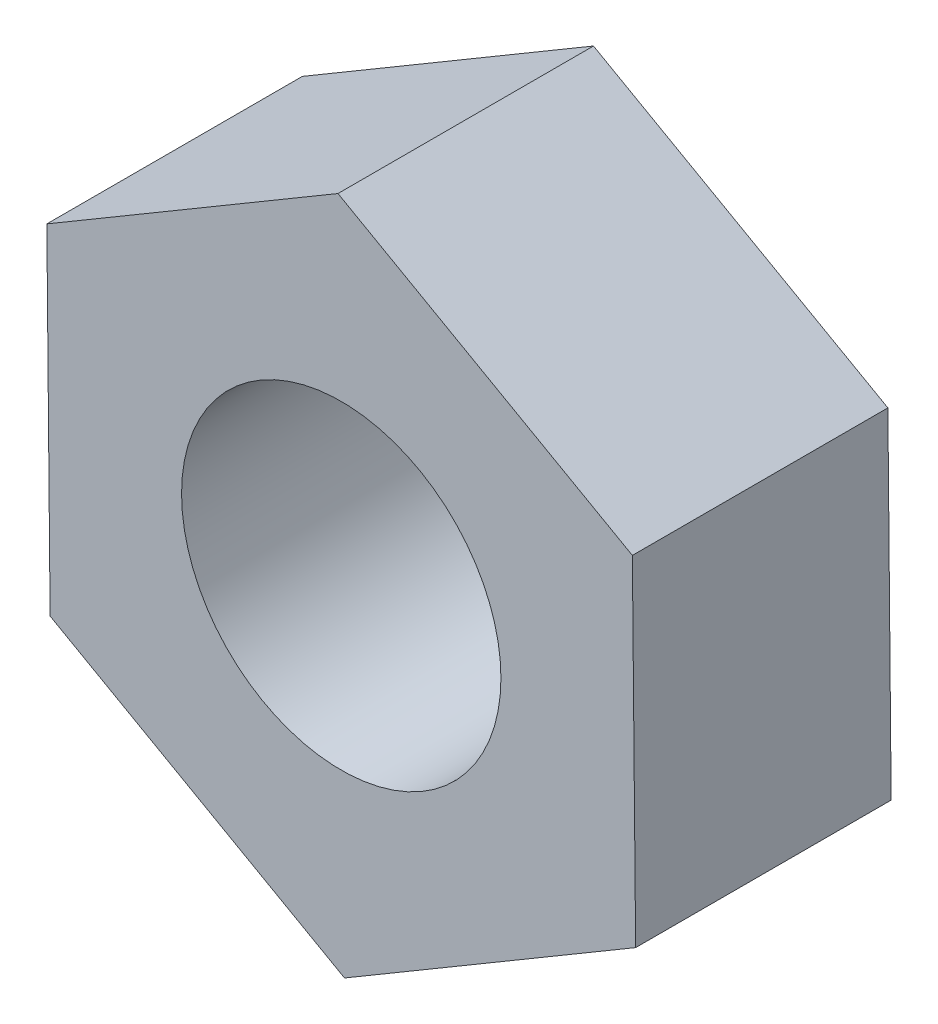
ISO-10303-21;
HEADER;
FILE_DESCRIPTION(('STEP AP214'),'2;1');
FILE_NAME('part.step','',(''),(''),'','','');
FILE_SCHEMA(('AUTOMOTIVE_DESIGN { 1 0 10303 214 1 1 1 1 }'));
ENDSEC;
DATA;
#1=APPLICATION_CONTEXT('core data for automotive mechanical design processes');
#2=APPLICATION_PROTOCOL_DEFINITION('international standard','automotive_design',2000,#1);
#3=PRODUCT_CONTEXT('',#1,'mechanical');
#4=PRODUCT('Part','Part','',(#3));
#5=PRODUCT_RELATED_PRODUCT_CATEGORY('part','',(#4));
#6=PRODUCT_DEFINITION_FORMATION('','',#4);
#7=PRODUCT_DEFINITION_CONTEXT('part definition',#1,'design');
#8=PRODUCT_DEFINITION('design','',#6,#7);
#9=PRODUCT_DEFINITION_SHAPE('','',#8);
#10=(LENGTH_UNIT() NAMED_UNIT(*) SI_UNIT(.MILLI.,.METRE.));
#11=(NAMED_UNIT(*) PLANE_ANGLE_UNIT() SI_UNIT($,.RADIAN.));
#12=(NAMED_UNIT(*) SI_UNIT($,.STERADIAN.) SOLID_ANGLE_UNIT());
#13=UNCERTAINTY_MEASURE_WITH_UNIT(LENGTH_MEASURE(1.E-05),#10,'distance_accuracy_value','');
#14=(GEOMETRIC_REPRESENTATION_CONTEXT(3) GLOBAL_UNCERTAINTY_ASSIGNED_CONTEXT((#13)) GLOBAL_UNIT_ASSIGNED_CONTEXT((#10,
#11,#12)) REPRESENTATION_CONTEXT('',''));
#15=CARTESIAN_POINT('',(0.,0.,0.));
#16=DIRECTION('',(0.,0.,1.));
#17=DIRECTION('',(1.,0.,0.));
#18=AXIS2_PLACEMENT_3D('',#15,#16,#17);
#19=CARTESIAN_POINT('',(0.,0.,2.4));
#20=DIRECTION('',(0.,0.,1.));
#21=DIRECTION('',(1.,0.,0.));
#22=AXIS2_PLACEMENT_3D('',#19,#20,#21);
#23=PLANE('',#22);
#24=DIRECTION('',(0.86114536562663,0.50835878989133,0.));
#25=VECTOR('',#24,1.);
#26=CARTESIAN_POINT('',(-6.3550111655688,20.9290963658217,2.4));
#27=LINE('',#26,#25);
#28=CARTESIAN_POINT('',(-6.3550111655688,20.9290963658217,2.4));
#29=VERTEX_POINT('',#28);
#30=CARTESIAN_POINT('',(-3.62050736796117,22.5433523288594,2.4));
#31=VERTEX_POINT('',#30);
#32=EDGE_CURVE('E133',#29,#31,#27,.T.);
#33=ORIENTED_EDGE('',*,*,#32,.T.);
#34=DIRECTION('',(-0.0096789434696921,0.999953157929566,0.));
#35=VECTOR('',#34,1.);
#36=CARTESIAN_POINT('',(-3.62050736796117,22.5433523288594,2.4));
#37=LINE('',#36,#35);
#38=CARTESIAN_POINT('',(-3.6512421413585,25.7186300658515,2.4));
#39=VERTEX_POINT('',#38);
#40=EDGE_CURVE('E91',#31,#39,#37,.T.);
#41=ORIENTED_EDGE('',*,*,#40,.T.);
#42=DIRECTION('',(-0.870824309096322,0.491594368038237,0.));
#43=VECTOR('',#42,1.);
#44=CARTESIAN_POINT('',(-3.6512421413585,25.7186300658515,2.4));
#45=LINE('',#44,#43);
#46=CARTESIAN_POINT('',(-6.41648071236348,27.2796518398058,2.4));
#47=VERTEX_POINT('',#46);
#48=EDGE_CURVE('E104',#39,#47,#45,.T.);
#49=ORIENTED_EDGE('',*,*,#48,.T.);
#50=DIRECTION('',(-0.86114536562663,-0.50835878989133,0.));
#51=VECTOR('',#50,1.);
#52=CARTESIAN_POINT('',(-6.41648071236348,27.2796518398058,2.4));
#53=LINE('',#52,#51);
#54=CARTESIAN_POINT('',(-9.15098450997112,25.6653958767681,2.4));
#55=VERTEX_POINT('',#54);
#56=EDGE_CURVE('E98',#47,#55,#53,.T.);
#57=ORIENTED_EDGE('',*,*,#56,.T.);
#58=DIRECTION('',(0.00967894346969265,-0.999953157929566,0.));
#59=VECTOR('',#58,1.);
#60=CARTESIAN_POINT('',(-9.15098450997112,25.6653958767681,2.4));
#61=LINE('',#60,#59);
#62=CARTESIAN_POINT('',(-9.12024973657378,22.4901181397761,2.4));
#63=VERTEX_POINT('',#62);
#64=EDGE_CURVE('E102',#55,#63,#61,.T.);
#65=ORIENTED_EDGE('',*,*,#64,.T.);
#66=DIRECTION('',(0.870824309096322,-0.491594368038236,0.));
#67=VECTOR('',#66,1.);
#68=CARTESIAN_POINT('',(-9.12024973657378,22.4901181397761,2.4));
#69=LINE('',#68,#67);
#70=EDGE_CURVE('E54',#63,#29,#69,.T.);
#71=ORIENTED_EDGE('',*,*,#70,.T.);
#72=EDGE_LOOP('',(#33,#41,#49,#57,#65,#71));
#73=FACE_BOUND('',#72,.T.);
#74=CARTESIAN_POINT('',(-6.38574593896614,24.1043741028138,2.4));
#75=DIRECTION('',(0.,0.,1.));
#76=DIRECTION('',(1.,0.,0.));
#77=AXIS2_PLACEMENT_3D('',#74,#75,#76);
#78=CIRCLE('',#77,1.5);
#79=CARTESIAN_POINT('',(-4.88574593896614,24.1043741028138,2.4));
#80=VERTEX_POINT('',#79);
#81=EDGE_CURVE('E126',#80,#80,#78,.T.);
#82=ORIENTED_EDGE('',*,*,#81,.F.);
#83=EDGE_LOOP('',(#82));
#84=FACE_BOUND('',#83,.T.);
#85=ADVANCED_FACE('F37',(#73,#84),#23,.T.);
#86=CARTESIAN_POINT('',(0.,0.,0.));
#87=DIRECTION('',(0.,0.,1.));
#88=DIRECTION('',(1.,0.,0.));
#89=AXIS2_PLACEMENT_3D('',#86,#87,#88);
#90=PLANE('',#89);
#91=DIRECTION('',(0.86114536562663,0.50835878989133,0.));
#92=VECTOR('',#91,1.);
#93=CARTESIAN_POINT('',(-6.3550111655688,20.9290963658217,0.));
#94=LINE('',#93,#92);
#95=CARTESIAN_POINT('',(-6.3550111655688,20.9290963658217,0.));
#96=VERTEX_POINT('',#95);
#97=CARTESIAN_POINT('',(-3.62050736796117,22.5433523288594,0.));
#98=VERTEX_POINT('',#97);
#99=EDGE_CURVE('E122',#96,#98,#94,.T.);
#100=ORIENTED_EDGE('',*,*,#99,.F.);
#101=DIRECTION('',(0.870824309096322,-0.491594368038236,0.));
#102=VECTOR('',#101,1.);
#103=CARTESIAN_POINT('',(-9.12024973657378,22.4901181397761,0.));
#104=LINE('',#103,#102);
#105=CARTESIAN_POINT('',(-9.12024973657378,22.4901181397761,0.));
#106=VERTEX_POINT('',#105);
#107=EDGE_CURVE('E83',#106,#96,#104,.T.);
#108=ORIENTED_EDGE('',*,*,#107,.F.);
#109=DIRECTION('',(0.00967894346969265,-0.999953157929566,0.));
#110=VECTOR('',#109,1.);
#111=CARTESIAN_POINT('',(-9.15098450997112,25.6653958767681,0.));
#112=LINE('',#111,#110);
#113=CARTESIAN_POINT('',(-9.15098450997112,25.6653958767681,0.));
#114=VERTEX_POINT('',#113);
#115=EDGE_CURVE('E77',#114,#106,#112,.T.);
#116=ORIENTED_EDGE('',*,*,#115,.F.);
#117=DIRECTION('',(-0.86114536562663,-0.50835878989133,0.));
#118=VECTOR('',#117,1.);
#119=CARTESIAN_POINT('',(-6.41648071236348,27.2796518398058,0.));
#120=LINE('',#119,#118);
#121=CARTESIAN_POINT('',(-6.41648071236348,27.2796518398058,0.));
#122=VERTEX_POINT('',#121);
#123=EDGE_CURVE('E112',#122,#114,#120,.T.);
#124=ORIENTED_EDGE('',*,*,#123,.F.);
#125=DIRECTION('',(-0.870824309096322,0.491594368038237,0.));
#126=VECTOR('',#125,1.);
#127=CARTESIAN_POINT('',(-3.6512421413585,25.7186300658515,0.));
#128=LINE('',#127,#126);
#129=CARTESIAN_POINT('',(-3.6512421413585,25.7186300658515,0.));
#130=VERTEX_POINT('',#129);
#131=EDGE_CURVE('E128',#130,#122,#128,.T.);
#132=ORIENTED_EDGE('',*,*,#131,.F.);
#133=DIRECTION('',(-0.0096789434696921,0.999953157929566,0.));
#134=VECTOR('',#133,1.);
#135=CARTESIAN_POINT('',(-3.62050736796117,22.5433523288594,0.));
#136=LINE('',#135,#134);
#137=EDGE_CURVE('E125',#98,#130,#136,.T.);
#138=ORIENTED_EDGE('',*,*,#137,.F.);
#139=EDGE_LOOP('',(#100,#108,#116,#124,#132,#138));
#140=FACE_BOUND('',#139,.T.);
#141=CARTESIAN_POINT('',(-6.38574593896614,24.1043741028138,0.));
#142=DIRECTION('',(0.,0.,1.));
#143=DIRECTION('',(1.,0.,0.));
#144=AXIS2_PLACEMENT_3D('',#141,#142,#143);
#145=CIRCLE('',#144,1.5);
#146=CARTESIAN_POINT('',(-4.88574593896614,24.1043741028138,0.));
#147=VERTEX_POINT('',#146);
#148=EDGE_CURVE('E226',#147,#147,#145,.T.);
#149=ORIENTED_EDGE('',*,*,#148,.T.);
#150=EDGE_LOOP('',(#149));
#151=FACE_BOUND('',#150,.T.);
#152=ADVANCED_FACE('F142',(#140,#151),#90,.F.);
#153=CARTESIAN_POINT('',(-6.3550111655688,20.9290963658217,2.4));
#154=DIRECTION('',(-0.50835878989133,0.86114536562663,0.));
#155=DIRECTION('',(-0.86114536562663,-0.50835878989133,0.));
#156=AXIS2_PLACEMENT_3D('',#153,#154,#155);
#157=PLANE('',#156);
#158=ORIENTED_EDGE('',*,*,#99,.T.);
#159=DIRECTION('',(0.,0.,-1.));
#160=VECTOR('',#159,1.);
#161=CARTESIAN_POINT('',(-3.62050736796117,22.5433523288594,2.4));
#162=LINE('',#161,#160);
#163=EDGE_CURVE('E11',#31,#98,#162,.T.);
#164=ORIENTED_EDGE('',*,*,#163,.F.);
#165=ORIENTED_EDGE('',*,*,#32,.F.);
#166=DIRECTION('',(0.,0.,-1.));
#167=VECTOR('',#166,1.);
#168=CARTESIAN_POINT('',(-6.3550111655688,20.9290963658217,2.4));
#169=LINE('',#168,#167);
#170=EDGE_CURVE('E118',#29,#96,#169,.T.);
#171=ORIENTED_EDGE('',*,*,#170,.T.);
#172=EDGE_LOOP('',(#158,#164,#165,#171));
#173=FACE_BOUND('',#172,.T.);
#174=ADVANCED_FACE('F39',(#173),#157,.F.);
#175=CARTESIAN_POINT('',(-3.62050736796117,22.5433523288594,2.4));
#176=DIRECTION('',(-0.999953157929566,-0.0096789434696921,0.));
#177=DIRECTION('',(0.0096789434696921,-0.999953157929566,0.));
#178=AXIS2_PLACEMENT_3D('',#175,#176,#177);
#179=PLANE('',#178);
#180=ORIENTED_EDGE('',*,*,#137,.T.);
#181=DIRECTION('',(0.,0.,-1.));
#182=VECTOR('',#181,1.);
#183=CARTESIAN_POINT('',(-3.6512421413585,25.7186300658515,2.4));
#184=LINE('',#183,#182);
#185=EDGE_CURVE('E46',#39,#130,#184,.T.);
#186=ORIENTED_EDGE('',*,*,#185,.F.);
#187=ORIENTED_EDGE('',*,*,#40,.F.);
#188=ORIENTED_EDGE('',*,*,#163,.T.);
#189=EDGE_LOOP('',(#180,#186,#187,#188));
#190=FACE_BOUND('',#189,.T.);
#191=ADVANCED_FACE('F167',(#190),#179,.F.);
#192=CARTESIAN_POINT('',(-3.6512421413585,25.7186300658515,2.4));
#193=DIRECTION('',(-0.491594368038236,-0.870824309096322,0.));
#194=DIRECTION('',(0.870824309096322,-0.491594368038237,0.));
#195=AXIS2_PLACEMENT_3D('',#192,#193,#194);
#196=PLANE('',#195);
#197=ORIENTED_EDGE('',*,*,#131,.T.);
#198=DIRECTION('',(0.,0.,-1.));
#199=VECTOR('',#198,1.);
#200=CARTESIAN_POINT('',(-6.41648071236348,27.2796518398058,2.4));
#201=LINE('',#200,#199);
#202=EDGE_CURVE('E113',#47,#122,#201,.T.);
#203=ORIENTED_EDGE('',*,*,#202,.F.);
#204=ORIENTED_EDGE('',*,*,#48,.F.);
#205=ORIENTED_EDGE('',*,*,#185,.T.);
#206=EDGE_LOOP('',(#197,#203,#204,#205));
#207=FACE_BOUND('',#206,.T.);
#208=ADVANCED_FACE('F139',(#207),#196,.F.);
#209=CARTESIAN_POINT('',(-6.41648071236348,27.2796518398058,2.4));
#210=DIRECTION('',(0.50835878989133,-0.86114536562663,0.));
#211=DIRECTION('',(0.86114536562663,0.50835878989133,0.));
#212=AXIS2_PLACEMENT_3D('',#209,#210,#211);
#213=PLANE('',#212);
#214=ORIENTED_EDGE('',*,*,#123,.T.);
#215=DIRECTION('',(0.,0.,-1.));
#216=VECTOR('',#215,1.);
#217=CARTESIAN_POINT('',(-9.15098450997112,25.6653958767681,2.4));
#218=LINE('',#217,#216);
#219=EDGE_CURVE('E109',#55,#114,#218,.T.);
#220=ORIENTED_EDGE('',*,*,#219,.F.);
#221=ORIENTED_EDGE('',*,*,#56,.F.);
#222=ORIENTED_EDGE('',*,*,#202,.T.);
#223=EDGE_LOOP('',(#214,#220,#221,#222));
#224=FACE_BOUND('',#223,.T.);
#225=ADVANCED_FACE('F110',(#224),#213,.F.);
#226=CARTESIAN_POINT('',(-9.15098450997112,25.6653958767681,2.4));
#227=DIRECTION('',(0.999953157929566,0.00967894346969265,0.));
#228=DIRECTION('',(-0.00967894346969265,0.999953157929566,0.));
#229=AXIS2_PLACEMENT_3D('',#226,#227,#228);
#230=PLANE('',#229);
#231=ORIENTED_EDGE('',*,*,#115,.T.);
#232=DIRECTION('',(0.,0.,-1.));
#233=VECTOR('',#232,1.);
#234=CARTESIAN_POINT('',(-9.12024973657378,22.4901181397761,2.4));
#235=LINE('',#234,#233);
#236=EDGE_CURVE('E114',#63,#106,#235,.T.);
#237=ORIENTED_EDGE('',*,*,#236,.F.);
#238=ORIENTED_EDGE('',*,*,#64,.F.);
#239=ORIENTED_EDGE('',*,*,#219,.T.);
#240=EDGE_LOOP('',(#231,#237,#238,#239));
#241=FACE_BOUND('',#240,.T.);
#242=ADVANCED_FACE('F116',(#241),#230,.F.);
#243=CARTESIAN_POINT('',(-9.12024973657378,22.4901181397761,2.4));
#244=DIRECTION('',(0.491594368038236,0.870824309096322,0.));
#245=DIRECTION('',(-0.870824309096322,0.491594368038236,0.));
#246=AXIS2_PLACEMENT_3D('',#243,#244,#245);
#247=PLANE('',#246);
#248=ORIENTED_EDGE('',*,*,#107,.T.);
#249=ORIENTED_EDGE('',*,*,#170,.F.);
#250=ORIENTED_EDGE('',*,*,#70,.F.);
#251=ORIENTED_EDGE('',*,*,#236,.T.);
#252=EDGE_LOOP('',(#248,#249,#250,#251));
#253=FACE_BOUND('',#252,.T.);
#254=ADVANCED_FACE('F147',(#253),#247,.F.);
#255=CARTESIAN_POINT('',(-6.38574593896614,24.1043741028138,2.4));
#256=DIRECTION('',(0.,0.,-1.));
#257=DIRECTION('',(-1.,0.,0.));
#258=AXIS2_PLACEMENT_3D('',#255,#256,#257);
#259=CYLINDRICAL_SURFACE('',#258,1.5);
#260=ORIENTED_EDGE('',*,*,#81,.T.);
#261=EDGE_LOOP('',(#260));
#262=FACE_BOUND('',#261,.T.);
#263=ORIENTED_EDGE('',*,*,#148,.F.);
#264=EDGE_LOOP('',(#263));
#265=FACE_BOUND('',#264,.T.);
#266=ADVANCED_FACE('F149',(#262,#265),#259,.F.);
#267=CLOSED_SHELL('',(#85,#152,#174,#191,#208,#225,#242,#254,#266));
#268=MANIFOLD_SOLID_BREP('B2',#267);
#269=ADVANCED_BREP_SHAPE_REPRESENTATION('',(#18,#268),#14);
#270=SHAPE_DEFINITION_REPRESENTATION(#9,#269);
ENDSEC;
END-ISO-10303-21;
